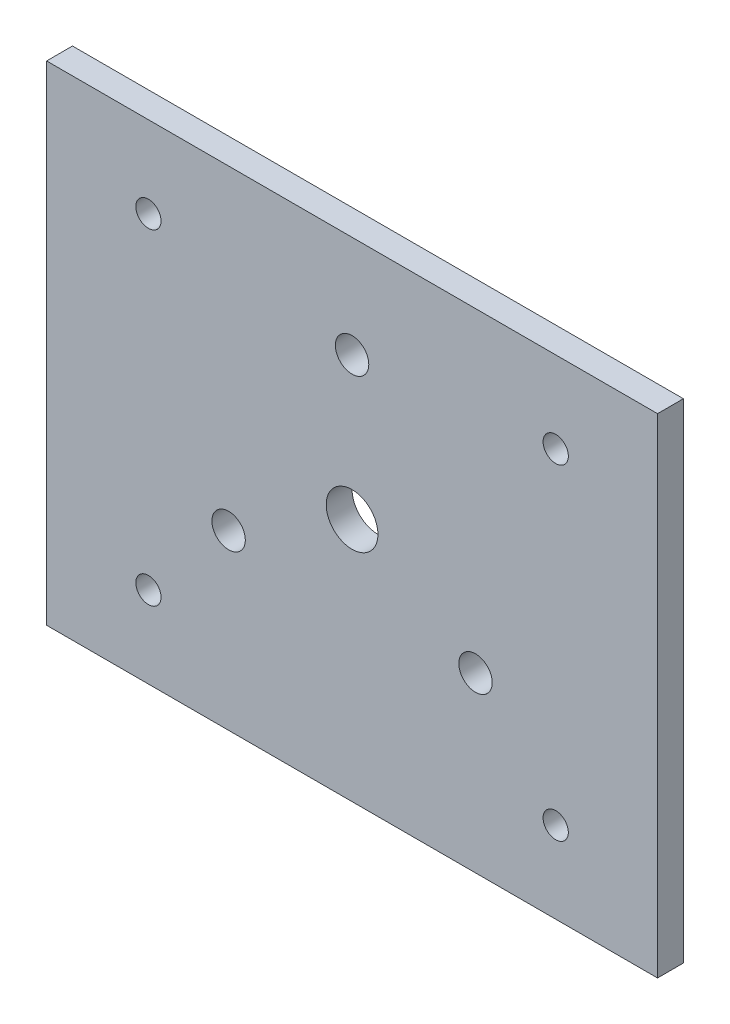
ISO-10303-21;
HEADER;
FILE_DESCRIPTION(('STEP AP214'),'2;1');
FILE_NAME('part.step','',(''),(''),'','','');
FILE_SCHEMA(('AUTOMOTIVE_DESIGN { 1 0 10303 214 1 1 1 1 }'));
ENDSEC;
DATA;
#1=APPLICATION_CONTEXT('core data for automotive mechanical design processes');
#2=APPLICATION_PROTOCOL_DEFINITION('international standard','automotive_design',2000,#1);
#3=PRODUCT_CONTEXT('',#1,'mechanical');
#4=PRODUCT('Part','Part','',(#3));
#5=PRODUCT_RELATED_PRODUCT_CATEGORY('part','',(#4));
#6=PRODUCT_DEFINITION_FORMATION('','',#4);
#7=PRODUCT_DEFINITION_CONTEXT('part definition',#1,'design');
#8=PRODUCT_DEFINITION('design','',#6,#7);
#9=PRODUCT_DEFINITION_SHAPE('','',#8);
#10=(LENGTH_UNIT() NAMED_UNIT(*) SI_UNIT(.MILLI.,.METRE.));
#11=(NAMED_UNIT(*) PLANE_ANGLE_UNIT() SI_UNIT($,.RADIAN.));
#12=(NAMED_UNIT(*) SI_UNIT($,.STERADIAN.) SOLID_ANGLE_UNIT());
#13=UNCERTAINTY_MEASURE_WITH_UNIT(LENGTH_MEASURE(1.E-05),#10,'distance_accuracy_value','');
#14=(GEOMETRIC_REPRESENTATION_CONTEXT(3) GLOBAL_UNCERTAINTY_ASSIGNED_CONTEXT((#13)) GLOBAL_UNIT_ASSIGNED_CONTEXT((#10,
#11,#12)) REPRESENTATION_CONTEXT('',''));
#15=CARTESIAN_POINT('',(0.,0.,0.));
#16=DIRECTION('',(0.,0.,1.));
#17=DIRECTION('',(1.,0.,0.));
#18=AXIS2_PLACEMENT_3D('',#15,#16,#17);
#19=CARTESIAN_POINT('',(75.,0.,6.35));
#20=DIRECTION('',(1.,0.,0.));
#21=DIRECTION('',(0.,1.,0.));
#22=AXIS2_PLACEMENT_3D('',#19,#20,#21);
#23=PLANE('',#22);
#24=DIRECTION('',(0.,-1.,0.));
#25=VECTOR('',#24,1.);
#26=CARTESIAN_POINT('',(75.,0.,0.));
#27=LINE('',#26,#25);
#28=CARTESIAN_POINT('',(75.,60.,0.));
#29=VERTEX_POINT('',#28);
#30=CARTESIAN_POINT('',(75.,-60.,0.));
#31=VERTEX_POINT('',#30);
#32=EDGE_CURVE('E147',#29,#31,#27,.T.);
#33=ORIENTED_EDGE('',*,*,#32,.F.);
#34=DIRECTION('',(0.,0.,-1.));
#35=VECTOR('',#34,1.);
#36=CARTESIAN_POINT('',(75.,60.,6.35));
#37=LINE('',#36,#35);
#38=CARTESIAN_POINT('',(75.,60.,6.35));
#39=VERTEX_POINT('',#38);
#40=EDGE_CURVE('E11',#39,#29,#37,.T.);
#41=ORIENTED_EDGE('',*,*,#40,.F.);
#42=DIRECTION('',(0.,-1.,0.));
#43=VECTOR('',#42,1.);
#44=CARTESIAN_POINT('',(75.,0.,6.35));
#45=LINE('',#44,#43);
#46=CARTESIAN_POINT('',(75.,-60.,6.35));
#47=VERTEX_POINT('',#46);
#48=EDGE_CURVE('E105',#39,#47,#45,.T.);
#49=ORIENTED_EDGE('',*,*,#48,.T.);
#50=DIRECTION('',(0.,0.,-1.));
#51=VECTOR('',#50,1.);
#52=CARTESIAN_POINT('',(75.,-60.,6.35));
#53=LINE('',#52,#51);
#54=EDGE_CURVE('E82',#47,#31,#53,.T.);
#55=ORIENTED_EDGE('',*,*,#54,.T.);
#56=EDGE_LOOP('',(#33,#41,#49,#55));
#57=FACE_BOUND('',#56,.T.);
#58=ADVANCED_FACE('F41',(#57),#23,.T.);
#59=CARTESIAN_POINT('',(0.,60.,6.35));
#60=DIRECTION('',(0.,1.,0.));
#61=DIRECTION('',(0.,0.,1.));
#62=AXIS2_PLACEMENT_3D('',#59,#60,#61);
#63=PLANE('',#62);
#64=DIRECTION('',(1.,0.,0.));
#65=VECTOR('',#64,1.);
#66=CARTESIAN_POINT('',(0.,60.,0.));
#67=LINE('',#66,#65);
#68=CARTESIAN_POINT('',(-75.,60.,0.));
#69=VERTEX_POINT('',#68);
#70=EDGE_CURVE('E94',#69,#29,#67,.T.);
#71=ORIENTED_EDGE('',*,*,#70,.F.);
#72=DIRECTION('',(0.,0.,-1.));
#73=VECTOR('',#72,1.);
#74=CARTESIAN_POINT('',(-75.,60.,6.35));
#75=LINE('',#74,#73);
#76=CARTESIAN_POINT('',(-75.,60.,6.35));
#77=VERTEX_POINT('',#76);
#78=EDGE_CURVE('E51',#77,#69,#75,.T.);
#79=ORIENTED_EDGE('',*,*,#78,.F.);
#80=DIRECTION('',(1.,0.,0.));
#81=VECTOR('',#80,1.);
#82=CARTESIAN_POINT('',(0.,60.,6.35));
#83=LINE('',#82,#81);
#84=EDGE_CURVE('E92',#77,#39,#83,.T.);
#85=ORIENTED_EDGE('',*,*,#84,.T.);
#86=ORIENTED_EDGE('',*,*,#40,.T.);
#87=EDGE_LOOP('',(#71,#79,#85,#86));
#88=FACE_BOUND('',#87,.T.);
#89=ADVANCED_FACE('F90',(#88),#63,.T.);
#90=CARTESIAN_POINT('',(-75.,0.,6.35));
#91=DIRECTION('',(1.,0.,0.));
#92=DIRECTION('',(0.,1.,0.));
#93=AXIS2_PLACEMENT_3D('',#90,#91,#92);
#94=PLANE('',#93);
#95=DIRECTION('',(0.,-1.,0.));
#96=VECTOR('',#95,1.);
#97=CARTESIAN_POINT('',(-75.,0.,0.));
#98=LINE('',#97,#96);
#99=CARTESIAN_POINT('',(-75.,-60.,0.));
#100=VERTEX_POINT('',#99);
#101=EDGE_CURVE('E152',#69,#100,#98,.T.);
#102=ORIENTED_EDGE('',*,*,#101,.T.);
#103=DIRECTION('',(0.,0.,-1.));
#104=VECTOR('',#103,1.);
#105=CARTESIAN_POINT('',(-75.,-60.,6.35));
#106=LINE('',#105,#104);
#107=CARTESIAN_POINT('',(-75.,-60.,6.35));
#108=VERTEX_POINT('',#107);
#109=EDGE_CURVE('E98',#108,#100,#106,.T.);
#110=ORIENTED_EDGE('',*,*,#109,.F.);
#111=DIRECTION('',(0.,-1.,0.));
#112=VECTOR('',#111,1.);
#113=CARTESIAN_POINT('',(-75.,0.,6.35));
#114=LINE('',#113,#112);
#115=EDGE_CURVE('E100',#77,#108,#114,.T.);
#116=ORIENTED_EDGE('',*,*,#115,.F.);
#117=ORIENTED_EDGE('',*,*,#78,.T.);
#118=EDGE_LOOP('',(#102,#110,#116,#117));
#119=FACE_BOUND('',#118,.T.);
#120=ADVANCED_FACE('F101',(#119),#94,.F.);
#121=CARTESIAN_POINT('',(0.,35.,6.35));
#122=DIRECTION('',(0.,0.,-1.));
#123=DIRECTION('',(-1.,0.,0.));
#124=AXIS2_PLACEMENT_3D('',#121,#122,#123);
#125=CYLINDRICAL_SURFACE('',#124,4.1);
#126=CARTESIAN_POINT('',(0.,35.,6.35));
#127=DIRECTION('',(0.,0.,1.));
#128=DIRECTION('',(1.,0.,0.));
#129=AXIS2_PLACEMENT_3D('',#126,#127,#128);
#130=CIRCLE('',#129,4.1);
#131=CARTESIAN_POINT('',(4.09999999999996,35.,6.35));
#132=VERTEX_POINT('',#131);
#133=EDGE_CURVE('E109',#132,#132,#130,.T.);
#134=ORIENTED_EDGE('',*,*,#133,.T.);
#135=EDGE_LOOP('',(#134));
#136=FACE_BOUND('',#135,.T.);
#137=CARTESIAN_POINT('',(0.,35.,0.));
#138=DIRECTION('',(0.,0.,1.));
#139=DIRECTION('',(1.,0.,0.));
#140=AXIS2_PLACEMENT_3D('',#137,#138,#139);
#141=CIRCLE('',#140,4.1);
#142=CARTESIAN_POINT('',(4.09999999999996,35.,0.));
#143=VERTEX_POINT('',#142);
#144=EDGE_CURVE('E143',#143,#143,#141,.T.);
#145=ORIENTED_EDGE('',*,*,#144,.F.);
#146=EDGE_LOOP('',(#145));
#147=FACE_BOUND('',#146,.T.);
#148=ADVANCED_FACE('F172',(#136,#147),#125,.F.);
#149=CARTESIAN_POINT('',(-50.,-40.,6.35));
#150=DIRECTION('',(0.,0.,-1.));
#151=DIRECTION('',(-1.,0.,0.));
#152=AXIS2_PLACEMENT_3D('',#149,#150,#151);
#153=CYLINDRICAL_SURFACE('',#152,3.1);
#154=CARTESIAN_POINT('',(-50.,-40.,6.35));
#155=DIRECTION('',(0.,0.,1.));
#156=DIRECTION('',(1.,0.,0.));
#157=AXIS2_PLACEMENT_3D('',#154,#155,#156);
#158=CIRCLE('',#157,3.1);
#159=CARTESIAN_POINT('',(-46.9,-40.,6.35));
#160=VERTEX_POINT('',#159);
#161=EDGE_CURVE('E340',#160,#160,#158,.T.);
#162=ORIENTED_EDGE('',*,*,#161,.T.);
#163=EDGE_LOOP('',(#162));
#164=FACE_BOUND('',#163,.T.);
#165=CARTESIAN_POINT('',(-50.,-40.,0.));
#166=DIRECTION('',(0.,0.,1.));
#167=DIRECTION('',(1.,0.,0.));
#168=AXIS2_PLACEMENT_3D('',#165,#166,#167);
#169=CIRCLE('',#168,3.1);
#170=CARTESIAN_POINT('',(-46.9,-40.,0.));
#171=VERTEX_POINT('',#170);
#172=EDGE_CURVE('E139',#171,#171,#169,.T.);
#173=ORIENTED_EDGE('',*,*,#172,.F.);
#174=EDGE_LOOP('',(#173));
#175=FACE_BOUND('',#174,.T.);
#176=ADVANCED_FACE('F175',(#164,#175),#153,.F.);
#177=CARTESIAN_POINT('',(30.3108891324553,-17.5,6.35));
#178=DIRECTION('',(0.,0.,-1.));
#179=DIRECTION('',(-1.,0.,0.));
#180=AXIS2_PLACEMENT_3D('',#177,#178,#179);
#181=CYLINDRICAL_SURFACE('',#180,4.10000000000014);
#182=CARTESIAN_POINT('',(30.3108891324553,-17.5,6.35));
#183=DIRECTION('',(0.,0.,1.));
#184=DIRECTION('',(1.,0.,0.));
#185=AXIS2_PLACEMENT_3D('',#182,#183,#184);
#186=CIRCLE('',#185,4.10000000000014);
#187=CARTESIAN_POINT('',(34.4108891324555,-17.5,6.35));
#188=VERTEX_POINT('',#187);
#189=EDGE_CURVE('E336',#188,#188,#186,.T.);
#190=ORIENTED_EDGE('',*,*,#189,.T.);
#191=EDGE_LOOP('',(#190));
#192=FACE_BOUND('',#191,.T.);
#193=CARTESIAN_POINT('',(30.3108891324553,-17.5,0.));
#194=DIRECTION('',(0.,0.,1.));
#195=DIRECTION('',(1.,0.,0.));
#196=AXIS2_PLACEMENT_3D('',#193,#194,#195);
#197=CIRCLE('',#196,4.10000000000014);
#198=CARTESIAN_POINT('',(34.4108891324555,-17.5,0.));
#199=VERTEX_POINT('',#198);
#200=EDGE_CURVE('E135',#199,#199,#197,.T.);
#201=ORIENTED_EDGE('',*,*,#200,.F.);
#202=EDGE_LOOP('',(#201));
#203=FACE_BOUND('',#202,.T.);
#204=ADVANCED_FACE('F179',(#192,#203),#181,.F.);
#205=CARTESIAN_POINT('',(-30.3108891324554,-17.5,6.35));
#206=DIRECTION('',(0.,0.,-1.));
#207=DIRECTION('',(-1.,0.,0.));
#208=AXIS2_PLACEMENT_3D('',#205,#206,#207);
#209=CYLINDRICAL_SURFACE('',#208,4.10000000000023);
#210=CARTESIAN_POINT('',(-30.3108891324554,-17.5,6.35));
#211=DIRECTION('',(0.,0.,1.));
#212=DIRECTION('',(1.,0.,0.));
#213=AXIS2_PLACEMENT_3D('',#210,#211,#212);
#214=CIRCLE('',#213,4.10000000000023);
#215=CARTESIAN_POINT('',(-26.2108891324552,-17.5,6.35));
#216=VERTEX_POINT('',#215);
#217=EDGE_CURVE('E332',#216,#216,#214,.T.);
#218=ORIENTED_EDGE('',*,*,#217,.T.);
#219=EDGE_LOOP('',(#218));
#220=FACE_BOUND('',#219,.T.);
#221=CARTESIAN_POINT('',(-30.3108891324554,-17.5,0.));
#222=DIRECTION('',(0.,0.,1.));
#223=DIRECTION('',(1.,0.,0.));
#224=AXIS2_PLACEMENT_3D('',#221,#222,#223);
#225=CIRCLE('',#224,4.10000000000023);
#226=CARTESIAN_POINT('',(-26.2108891324552,-17.5,0.));
#227=VERTEX_POINT('',#226);
#228=EDGE_CURVE('E131',#227,#227,#225,.T.);
#229=ORIENTED_EDGE('',*,*,#228,.F.);
#230=EDGE_LOOP('',(#229));
#231=FACE_BOUND('',#230,.T.);
#232=ADVANCED_FACE('F183',(#220,#231),#209,.F.);
#233=CARTESIAN_POINT('',(50.,-40.,6.35));
#234=DIRECTION('',(0.,0.,-1.));
#235=DIRECTION('',(-1.,0.,0.));
#236=AXIS2_PLACEMENT_3D('',#233,#234,#235);
#237=CYLINDRICAL_SURFACE('',#236,3.1);
#238=CARTESIAN_POINT('',(50.,-40.,6.35));
#239=DIRECTION('',(0.,0.,1.));
#240=DIRECTION('',(1.,0.,0.));
#241=AXIS2_PLACEMENT_3D('',#238,#239,#240);
#242=CIRCLE('',#241,3.1);
#243=CARTESIAN_POINT('',(53.1,-40.,6.35));
#244=VERTEX_POINT('',#243);
#245=EDGE_CURVE('E328',#244,#244,#242,.T.);
#246=ORIENTED_EDGE('',*,*,#245,.T.);
#247=EDGE_LOOP('',(#246));
#248=FACE_BOUND('',#247,.T.);
#249=CARTESIAN_POINT('',(50.,-40.,0.));
#250=DIRECTION('',(0.,0.,1.));
#251=DIRECTION('',(1.,0.,0.));
#252=AXIS2_PLACEMENT_3D('',#249,#250,#251);
#253=CIRCLE('',#252,3.1);
#254=CARTESIAN_POINT('',(53.1,-40.,0.));
#255=VERTEX_POINT('',#254);
#256=EDGE_CURVE('E127',#255,#255,#253,.T.);
#257=ORIENTED_EDGE('',*,*,#256,.F.);
#258=EDGE_LOOP('',(#257));
#259=FACE_BOUND('',#258,.T.);
#260=ADVANCED_FACE('F187',(#248,#259),#237,.F.);
#261=CARTESIAN_POINT('',(50.,40.,6.35));
#262=DIRECTION('',(0.,0.,-1.));
#263=DIRECTION('',(-1.,0.,0.));
#264=AXIS2_PLACEMENT_3D('',#261,#262,#263);
#265=CYLINDRICAL_SURFACE('',#264,3.1);
#266=CARTESIAN_POINT('',(50.,40.,6.35));
#267=DIRECTION('',(0.,0.,1.));
#268=DIRECTION('',(1.,0.,0.));
#269=AXIS2_PLACEMENT_3D('',#266,#267,#268);
#270=CIRCLE('',#269,3.1);
#271=CARTESIAN_POINT('',(53.1,40.,6.35));
#272=VERTEX_POINT('',#271);
#273=EDGE_CURVE('E324',#272,#272,#270,.T.);
#274=ORIENTED_EDGE('',*,*,#273,.T.);
#275=EDGE_LOOP('',(#274));
#276=FACE_BOUND('',#275,.T.);
#277=CARTESIAN_POINT('',(50.,40.,0.));
#278=DIRECTION('',(0.,0.,1.));
#279=DIRECTION('',(1.,0.,0.));
#280=AXIS2_PLACEMENT_3D('',#277,#278,#279);
#281=CIRCLE('',#280,3.1);
#282=CARTESIAN_POINT('',(53.1,40.,0.));
#283=VERTEX_POINT('',#282);
#284=EDGE_CURVE('E123',#283,#283,#281,.T.);
#285=ORIENTED_EDGE('',*,*,#284,.F.);
#286=EDGE_LOOP('',(#285));
#287=FACE_BOUND('',#286,.T.);
#288=ADVANCED_FACE('F191',(#276,#287),#265,.F.);
#289=CARTESIAN_POINT('',(-50.,40.,6.35));
#290=DIRECTION('',(0.,0.,-1.));
#291=DIRECTION('',(-1.,0.,0.));
#292=AXIS2_PLACEMENT_3D('',#289,#290,#291);
#293=CYLINDRICAL_SURFACE('',#292,3.09999999999999);
#294=CARTESIAN_POINT('',(-50.,40.,6.35));
#295=DIRECTION('',(0.,0.,1.));
#296=DIRECTION('',(1.,0.,0.));
#297=AXIS2_PLACEMENT_3D('',#294,#295,#296);
#298=CIRCLE('',#297,3.09999999999999);
#299=CARTESIAN_POINT('',(-46.9,40.,6.35));
#300=VERTEX_POINT('',#299);
#301=EDGE_CURVE('E205',#300,#300,#298,.T.);
#302=ORIENTED_EDGE('',*,*,#301,.T.);
#303=EDGE_LOOP('',(#302));
#304=FACE_BOUND('',#303,.T.);
#305=CARTESIAN_POINT('',(-50.,40.,0.));
#306=DIRECTION('',(0.,0.,1.));
#307=DIRECTION('',(1.,0.,0.));
#308=AXIS2_PLACEMENT_3D('',#305,#306,#307);
#309=CIRCLE('',#308,3.09999999999999);
#310=CARTESIAN_POINT('',(-46.9,40.,0.));
#311=VERTEX_POINT('',#310);
#312=EDGE_CURVE('E119',#311,#311,#309,.T.);
#313=ORIENTED_EDGE('',*,*,#312,.F.);
#314=EDGE_LOOP('',(#313));
#315=FACE_BOUND('',#314,.T.);
#316=ADVANCED_FACE('F194',(#304,#315),#293,.F.);
#317=CARTESIAN_POINT('',(0.,0.,6.35));
#318=DIRECTION('',(0.,0.,-1.));
#319=DIRECTION('',(-1.,0.,0.));
#320=AXIS2_PLACEMENT_3D('',#317,#318,#319);
#321=CYLINDRICAL_SURFACE('',#320,6.35);
#322=CARTESIAN_POINT('',(0.,0.,6.35));
#323=DIRECTION('',(0.,0.,1.));
#324=DIRECTION('',(1.,0.,0.));
#325=AXIS2_PLACEMENT_3D('',#322,#323,#324);
#326=CIRCLE('',#325,6.35);
#327=CARTESIAN_POINT('',(6.34999999999999,0.,6.35));
#328=VERTEX_POINT('',#327);
#329=EDGE_CURVE('E157',#328,#328,#326,.T.);
#330=ORIENTED_EDGE('',*,*,#329,.T.);
#331=EDGE_LOOP('',(#330));
#332=FACE_BOUND('',#331,.T.);
#333=CARTESIAN_POINT('',(0.,0.,0.));
#334=DIRECTION('',(0.,0.,1.));
#335=DIRECTION('',(1.,0.,0.));
#336=AXIS2_PLACEMENT_3D('',#333,#334,#335);
#337=CIRCLE('',#336,6.35);
#338=CARTESIAN_POINT('',(6.34999999999999,0.,0.));
#339=VERTEX_POINT('',#338);
#340=EDGE_CURVE('E115',#339,#339,#337,.T.);
#341=ORIENTED_EDGE('',*,*,#340,.F.);
#342=EDGE_LOOP('',(#341));
#343=FACE_BOUND('',#342,.T.);
#344=ADVANCED_FACE('F43',(#332,#343),#321,.F.);
#345=CARTESIAN_POINT('',(0.,-60.,6.35));
#346=DIRECTION('',(0.,1.,0.));
#347=DIRECTION('',(0.,0.,1.));
#348=AXIS2_PLACEMENT_3D('',#345,#346,#347);
#349=PLANE('',#348);
#350=DIRECTION('',(1.,0.,0.));
#351=VECTOR('',#350,1.);
#352=CARTESIAN_POINT('',(0.,-60.,0.));
#353=LINE('',#352,#351);
#354=EDGE_CURVE('E75',#100,#31,#353,.T.);
#355=ORIENTED_EDGE('',*,*,#354,.T.);
#356=ORIENTED_EDGE('',*,*,#54,.F.);
#357=DIRECTION('',(1.,0.,0.));
#358=VECTOR('',#357,1.);
#359=CARTESIAN_POINT('',(0.,-60.,6.35));
#360=LINE('',#359,#358);
#361=EDGE_CURVE('E59',#108,#47,#360,.T.);
#362=ORIENTED_EDGE('',*,*,#361,.F.);
#363=ORIENTED_EDGE('',*,*,#109,.T.);
#364=EDGE_LOOP('',(#355,#356,#362,#363));
#365=FACE_BOUND('',#364,.T.);
#366=ADVANCED_FACE('F162',(#365),#349,.F.);
#367=CARTESIAN_POINT('',(0.,0.,6.35));
#368=DIRECTION('',(0.,0.,1.));
#369=DIRECTION('',(1.,0.,0.));
#370=AXIS2_PLACEMENT_3D('',#367,#368,#369);
#371=PLANE('',#370);
#372=ORIENTED_EDGE('',*,*,#329,.F.);
#373=EDGE_LOOP('',(#372));
#374=FACE_BOUND('',#373,.T.);
#375=ORIENTED_EDGE('',*,*,#301,.F.);
#376=EDGE_LOOP('',(#375));
#377=FACE_BOUND('',#376,.T.);
#378=ORIENTED_EDGE('',*,*,#273,.F.);
#379=EDGE_LOOP('',(#378));
#380=FACE_BOUND('',#379,.T.);
#381=ORIENTED_EDGE('',*,*,#245,.F.);
#382=EDGE_LOOP('',(#381));
#383=FACE_BOUND('',#382,.T.);
#384=ORIENTED_EDGE('',*,*,#217,.F.);
#385=EDGE_LOOP('',(#384));
#386=FACE_BOUND('',#385,.T.);
#387=ORIENTED_EDGE('',*,*,#189,.F.);
#388=EDGE_LOOP('',(#387));
#389=FACE_BOUND('',#388,.T.);
#390=ORIENTED_EDGE('',*,*,#161,.F.);
#391=EDGE_LOOP('',(#390));
#392=FACE_BOUND('',#391,.T.);
#393=ORIENTED_EDGE('',*,*,#133,.F.);
#394=EDGE_LOOP('',(#393));
#395=FACE_BOUND('',#394,.T.);
#396=ORIENTED_EDGE('',*,*,#48,.F.);
#397=ORIENTED_EDGE('',*,*,#84,.F.);
#398=ORIENTED_EDGE('',*,*,#115,.T.);
#399=ORIENTED_EDGE('',*,*,#361,.T.);
#400=EDGE_LOOP('',(#396,#397,#398,#399));
#401=FACE_BOUND('',#400,.T.);
#402=ADVANCED_FACE('F104',(#374,#377,#380,#383,#386,#389,#392,#395,#401),#371,.T.);
#403=CARTESIAN_POINT('',(0.,0.,0.));
#404=DIRECTION('',(0.,0.,1.));
#405=DIRECTION('',(1.,0.,0.));
#406=AXIS2_PLACEMENT_3D('',#403,#404,#405);
#407=PLANE('',#406);
#408=ORIENTED_EDGE('',*,*,#340,.T.);
#409=EDGE_LOOP('',(#408));
#410=FACE_BOUND('',#409,.T.);
#411=ORIENTED_EDGE('',*,*,#312,.T.);
#412=EDGE_LOOP('',(#411));
#413=FACE_BOUND('',#412,.T.);
#414=ORIENTED_EDGE('',*,*,#284,.T.);
#415=EDGE_LOOP('',(#414));
#416=FACE_BOUND('',#415,.T.);
#417=ORIENTED_EDGE('',*,*,#256,.T.);
#418=EDGE_LOOP('',(#417));
#419=FACE_BOUND('',#418,.T.);
#420=ORIENTED_EDGE('',*,*,#228,.T.);
#421=EDGE_LOOP('',(#420));
#422=FACE_BOUND('',#421,.T.);
#423=ORIENTED_EDGE('',*,*,#200,.T.);
#424=EDGE_LOOP('',(#423));
#425=FACE_BOUND('',#424,.T.);
#426=ORIENTED_EDGE('',*,*,#172,.T.);
#427=EDGE_LOOP('',(#426));
#428=FACE_BOUND('',#427,.T.);
#429=ORIENTED_EDGE('',*,*,#144,.T.);
#430=EDGE_LOOP('',(#429));
#431=FACE_BOUND('',#430,.T.);
#432=ORIENTED_EDGE('',*,*,#32,.T.);
#433=ORIENTED_EDGE('',*,*,#354,.F.);
#434=ORIENTED_EDGE('',*,*,#101,.F.);
#435=ORIENTED_EDGE('',*,*,#70,.T.);
#436=EDGE_LOOP('',(#432,#433,#434,#435));
#437=FACE_BOUND('',#436,.T.);
#438=ADVANCED_FACE('F163',(#410,#413,#416,#419,#422,#425,#428,#431,#437),#407,.F.);
#439=CLOSED_SHELL('',(#58,#89,#120,#148,#176,#204,#232,#260,#288,#316,#344,#366,#402,#438));
#440=MANIFOLD_SOLID_BREP('B2',#439);
#441=ADVANCED_BREP_SHAPE_REPRESENTATION('',(#18,#440),#14);
#442=SHAPE_DEFINITION_REPRESENTATION(#9,#441);
ENDSEC;
END-ISO-10303-21;
